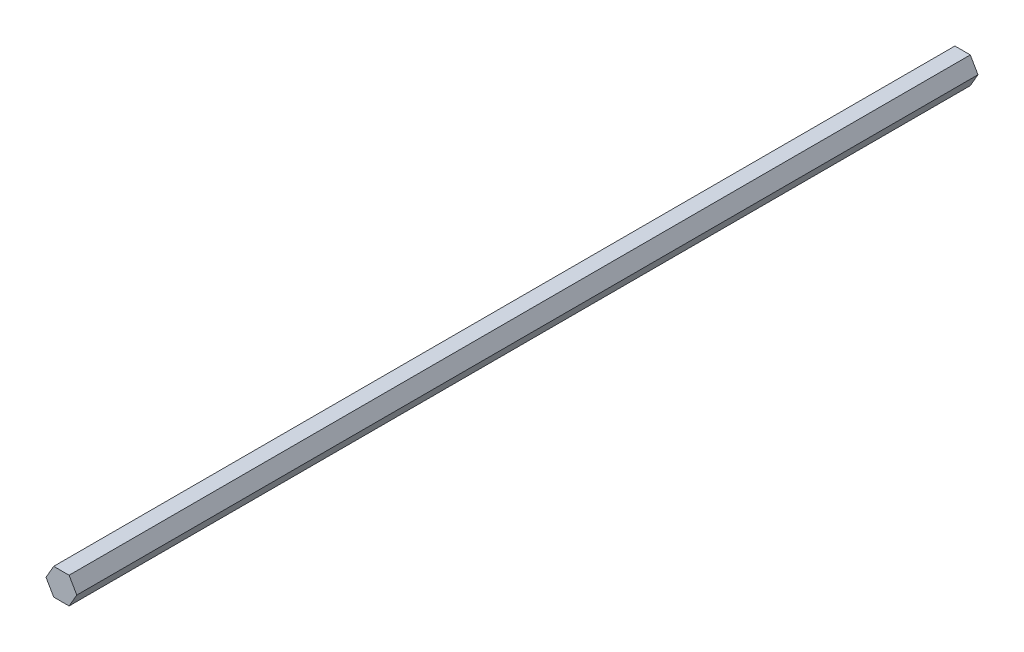
ISO-10303-21;
HEADER;
FILE_DESCRIPTION(('STEP AP214'),'2;1');
FILE_NAME('part.step','',(''),(''),'','','');
FILE_SCHEMA(('AUTOMOTIVE_DESIGN { 1 0 10303 214 1 1 1 1 }'));
ENDSEC;
DATA;
#1=APPLICATION_CONTEXT('core data for automotive mechanical design processes');
#2=APPLICATION_PROTOCOL_DEFINITION('international standard','automotive_design',2000,#1);
#3=PRODUCT_CONTEXT('',#1,'mechanical');
#4=PRODUCT('Part','Part','',(#3));
#5=PRODUCT_RELATED_PRODUCT_CATEGORY('part','',(#4));
#6=PRODUCT_DEFINITION_FORMATION('','',#4);
#7=PRODUCT_DEFINITION_CONTEXT('part definition',#1,'design');
#8=PRODUCT_DEFINITION('design','',#6,#7);
#9=PRODUCT_DEFINITION_SHAPE('','',#8);
#10=(LENGTH_UNIT() NAMED_UNIT(*) SI_UNIT(.MILLI.,.METRE.));
#11=(NAMED_UNIT(*) PLANE_ANGLE_UNIT() SI_UNIT($,.RADIAN.));
#12=(NAMED_UNIT(*) SI_UNIT($,.STERADIAN.) SOLID_ANGLE_UNIT());
#13=UNCERTAINTY_MEASURE_WITH_UNIT(LENGTH_MEASURE(1.E-05),#10,'distance_accuracy_value','');
#14=(GEOMETRIC_REPRESENTATION_CONTEXT(3) GLOBAL_UNCERTAINTY_ASSIGNED_CONTEXT((#13)) GLOBAL_UNIT_ASSIGNED_CONTEXT((#10,
#11,#12)) REPRESENTATION_CONTEXT('',''));
#15=CARTESIAN_POINT('',(0.,0.,0.));
#16=DIRECTION('',(0.,0.,1.));
#17=DIRECTION('',(1.,0.,0.));
#18=AXIS2_PLACEMENT_3D('',#15,#16,#17);
#19=CARTESIAN_POINT('',(3.615,6.26136366936149,423.18));
#20=DIRECTION('',(0.,-1.,0.));
#21=DIRECTION('',(1.,0.,0.));
#22=AXIS2_PLACEMENT_3D('',#19,#20,#21);
#23=PLANE('',#22);
#24=DIRECTION('',(-1.,0.,0.));
#25=VECTOR('',#24,1.);
#26=CARTESIAN_POINT('',(3.615,6.26136366936149,0.));
#27=LINE('',#26,#25);
#28=CARTESIAN_POINT('',(3.615,6.26136366936149,0.));
#29=VERTEX_POINT('',#28);
#30=CARTESIAN_POINT('',(-3.615,6.26136366936149,0.));
#31=VERTEX_POINT('',#30);
#32=EDGE_CURVE('E117',#29,#31,#27,.T.);
#33=ORIENTED_EDGE('',*,*,#32,.T.);
#34=DIRECTION('',(0.,0.,-1.));
#35=VECTOR('',#34,1.);
#36=CARTESIAN_POINT('',(-3.615,6.26136366936149,423.18));
#37=LINE('',#36,#35);
#38=CARTESIAN_POINT('',(-3.615,6.26136366936149,423.18));
#39=VERTEX_POINT('',#38);
#40=EDGE_CURVE('E11',#39,#31,#37,.T.);
#41=ORIENTED_EDGE('',*,*,#40,.F.);
#42=DIRECTION('',(-1.,0.,0.));
#43=VECTOR('',#42,1.);
#44=CARTESIAN_POINT('',(3.615,6.26136366936149,423.18));
#45=LINE('',#44,#43);
#46=CARTESIAN_POINT('',(3.615,6.26136366936149,423.18));
#47=VERTEX_POINT('',#46);
#48=EDGE_CURVE('E127',#47,#39,#45,.T.);
#49=ORIENTED_EDGE('',*,*,#48,.F.);
#50=DIRECTION('',(0.,0.,-1.));
#51=VECTOR('',#50,1.);
#52=CARTESIAN_POINT('',(3.615,6.26136366936149,423.18));
#53=LINE('',#52,#51);
#54=EDGE_CURVE('E113',#47,#29,#53,.T.);
#55=ORIENTED_EDGE('',*,*,#54,.T.);
#56=EDGE_LOOP('',(#33,#41,#49,#55));
#57=FACE_BOUND('',#56,.T.);
#58=ADVANCED_FACE('F33',(#57),#23,.F.);
#59=CARTESIAN_POINT('',(-3.615,6.26136366936149,423.18));
#60=DIRECTION('',(0.866025403784439,-0.5,0.));
#61=DIRECTION('',(0.5,0.866025403784439,0.));
#62=AXIS2_PLACEMENT_3D('',#59,#60,#61);
#63=PLANE('',#62);
#64=DIRECTION('',(-0.5,-0.866025403784439,0.));
#65=VECTOR('',#64,1.);
#66=CARTESIAN_POINT('',(-3.615,6.26136366936149,0.));
#67=LINE('',#66,#65);
#68=CARTESIAN_POINT('',(-7.23,0.,0.));
#69=VERTEX_POINT('',#68);
#70=EDGE_CURVE('E120',#31,#69,#67,.T.);
#71=ORIENTED_EDGE('',*,*,#70,.T.);
#72=DIRECTION('',(0.,0.,-1.));
#73=VECTOR('',#72,1.);
#74=CARTESIAN_POINT('',(-7.23,0.,423.18));
#75=LINE('',#74,#73);
#76=CARTESIAN_POINT('',(-7.23,0.,423.18));
#77=VERTEX_POINT('',#76);
#78=EDGE_CURVE('E41',#77,#69,#75,.T.);
#79=ORIENTED_EDGE('',*,*,#78,.F.);
#80=DIRECTION('',(-0.5,-0.866025403784439,0.));
#81=VECTOR('',#80,1.);
#82=CARTESIAN_POINT('',(-3.615,6.26136366936149,423.18));
#83=LINE('',#82,#81);
#84=EDGE_CURVE('E86',#39,#77,#83,.T.);
#85=ORIENTED_EDGE('',*,*,#84,.F.);
#86=ORIENTED_EDGE('',*,*,#40,.T.);
#87=EDGE_LOOP('',(#71,#79,#85,#86));
#88=FACE_BOUND('',#87,.T.);
#89=ADVANCED_FACE('F151',(#88),#63,.F.);
#90=CARTESIAN_POINT('',(-7.23,0.,423.18));
#91=DIRECTION('',(0.866025403784438,0.5,0.));
#92=DIRECTION('',(-0.5,0.866025403784439,0.));
#93=AXIS2_PLACEMENT_3D('',#90,#91,#92);
#94=PLANE('',#93);
#95=DIRECTION('',(0.5,-0.866025403784438,0.));
#96=VECTOR('',#95,1.);
#97=CARTESIAN_POINT('',(-7.23,0.,0.));
#98=LINE('',#97,#96);
#99=CARTESIAN_POINT('',(-3.615,-6.26136366936149,0.));
#100=VERTEX_POINT('',#99);
#101=EDGE_CURVE('E122',#69,#100,#98,.T.);
#102=ORIENTED_EDGE('',*,*,#101,.T.);
#103=DIRECTION('',(0.,0.,-1.));
#104=VECTOR('',#103,1.);
#105=CARTESIAN_POINT('',(-3.615,-6.26136366936149,423.18));
#106=LINE('',#105,#104);
#107=CARTESIAN_POINT('',(-3.615,-6.26136366936149,423.18));
#108=VERTEX_POINT('',#107);
#109=EDGE_CURVE('E108',#108,#100,#106,.T.);
#110=ORIENTED_EDGE('',*,*,#109,.F.);
#111=DIRECTION('',(0.5,-0.866025403784438,0.));
#112=VECTOR('',#111,1.);
#113=CARTESIAN_POINT('',(-7.23,0.,423.18));
#114=LINE('',#113,#112);
#115=EDGE_CURVE('E99',#77,#108,#114,.T.);
#116=ORIENTED_EDGE('',*,*,#115,.F.);
#117=ORIENTED_EDGE('',*,*,#78,.T.);
#118=EDGE_LOOP('',(#102,#110,#116,#117));
#119=FACE_BOUND('',#118,.T.);
#120=ADVANCED_FACE('F133',(#119),#94,.F.);
#121=CARTESIAN_POINT('',(-3.615,-6.26136366936149,423.18));
#122=DIRECTION('',(0.,1.,0.));
#123=DIRECTION('',(0.,0.,1.));
#124=AXIS2_PLACEMENT_3D('',#121,#122,#123);
#125=PLANE('',#124);
#126=DIRECTION('',(1.,0.,0.));
#127=VECTOR('',#126,1.);
#128=CARTESIAN_POINT('',(-3.615,-6.26136366936149,0.));
#129=LINE('',#128,#127);
#130=CARTESIAN_POINT('',(3.615,-6.26136366936149,0.));
#131=VERTEX_POINT('',#130);
#132=EDGE_CURVE('E107',#100,#131,#129,.T.);
#133=ORIENTED_EDGE('',*,*,#132,.T.);
#134=DIRECTION('',(0.,0.,-1.));
#135=VECTOR('',#134,1.);
#136=CARTESIAN_POINT('',(3.615,-6.26136366936149,423.18));
#137=LINE('',#136,#135);
#138=CARTESIAN_POINT('',(3.615,-6.26136366936149,423.18));
#139=VERTEX_POINT('',#138);
#140=EDGE_CURVE('E104',#139,#131,#137,.T.);
#141=ORIENTED_EDGE('',*,*,#140,.F.);
#142=DIRECTION('',(1.,0.,0.));
#143=VECTOR('',#142,1.);
#144=CARTESIAN_POINT('',(-3.615,-6.26136366936149,423.18));
#145=LINE('',#144,#143);
#146=EDGE_CURVE('E93',#108,#139,#145,.T.);
#147=ORIENTED_EDGE('',*,*,#146,.F.);
#148=ORIENTED_EDGE('',*,*,#109,.T.);
#149=EDGE_LOOP('',(#133,#141,#147,#148));
#150=FACE_BOUND('',#149,.T.);
#151=ADVANCED_FACE('F105',(#150),#125,.F.);
#152=CARTESIAN_POINT('',(3.615,-6.26136366936149,423.18));
#153=DIRECTION('',(-0.866025403784439,0.5,0.));
#154=DIRECTION('',(-0.5,-0.866025403784439,0.));
#155=AXIS2_PLACEMENT_3D('',#152,#153,#154);
#156=PLANE('',#155);
#157=DIRECTION('',(0.5,0.866025403784439,0.));
#158=VECTOR('',#157,1.);
#159=CARTESIAN_POINT('',(3.615,-6.26136366936149,0.));
#160=LINE('',#159,#158);
#161=CARTESIAN_POINT('',(7.23,0.,0.));
#162=VERTEX_POINT('',#161);
#163=EDGE_CURVE('E72',#131,#162,#160,.T.);
#164=ORIENTED_EDGE('',*,*,#163,.T.);
#165=DIRECTION('',(0.,0.,-1.));
#166=VECTOR('',#165,1.);
#167=CARTESIAN_POINT('',(7.23,0.,423.18));
#168=LINE('',#167,#166);
#169=CARTESIAN_POINT('',(7.23,0.,423.18));
#170=VERTEX_POINT('',#169);
#171=EDGE_CURVE('E109',#170,#162,#168,.T.);
#172=ORIENTED_EDGE('',*,*,#171,.F.);
#173=DIRECTION('',(0.5,0.866025403784439,0.));
#174=VECTOR('',#173,1.);
#175=CARTESIAN_POINT('',(3.615,-6.26136366936149,423.18));
#176=LINE('',#175,#174);
#177=EDGE_CURVE('E97',#139,#170,#176,.T.);
#178=ORIENTED_EDGE('',*,*,#177,.F.);
#179=ORIENTED_EDGE('',*,*,#140,.T.);
#180=EDGE_LOOP('',(#164,#172,#178,#179));
#181=FACE_BOUND('',#180,.T.);
#182=ADVANCED_FACE('F111',(#181),#156,.F.);
#183=CARTESIAN_POINT('',(7.23,0.,423.18));
#184=DIRECTION('',(-0.866025403784439,-0.5,0.));
#185=DIRECTION('',(0.5,-0.866025403784439,0.));
#186=AXIS2_PLACEMENT_3D('',#183,#184,#185);
#187=PLANE('',#186);
#188=DIRECTION('',(-0.5,0.866025403784439,0.));
#189=VECTOR('',#188,1.);
#190=CARTESIAN_POINT('',(7.23,0.,0.));
#191=LINE('',#190,#189);
#192=EDGE_CURVE('E78',#162,#29,#191,.T.);
#193=ORIENTED_EDGE('',*,*,#192,.T.);
#194=ORIENTED_EDGE('',*,*,#54,.F.);
#195=DIRECTION('',(-0.5,0.866025403784439,0.));
#196=VECTOR('',#195,1.);
#197=CARTESIAN_POINT('',(7.23,0.,423.18));
#198=LINE('',#197,#196);
#199=EDGE_CURVE('E49',#170,#47,#198,.T.);
#200=ORIENTED_EDGE('',*,*,#199,.F.);
#201=ORIENTED_EDGE('',*,*,#171,.T.);
#202=EDGE_LOOP('',(#193,#194,#200,#201));
#203=FACE_BOUND('',#202,.T.);
#204=ADVANCED_FACE('F140',(#203),#187,.F.);
#205=CARTESIAN_POINT('',(0.,0.,423.18));
#206=DIRECTION('',(0.,0.,1.));
#207=DIRECTION('',(1.,0.,0.));
#208=AXIS2_PLACEMENT_3D('',#205,#206,#207);
#209=PLANE('',#208);
#210=ORIENTED_EDGE('',*,*,#48,.T.);
#211=ORIENTED_EDGE('',*,*,#84,.T.);
#212=ORIENTED_EDGE('',*,*,#115,.T.);
#213=ORIENTED_EDGE('',*,*,#146,.T.);
#214=ORIENTED_EDGE('',*,*,#177,.T.);
#215=ORIENTED_EDGE('',*,*,#199,.T.);
#216=EDGE_LOOP('',(#210,#211,#212,#213,#214,#215));
#217=FACE_BOUND('',#216,.T.);
#218=ADVANCED_FACE('F95',(#217),#209,.T.);
#219=CARTESIAN_POINT('',(0.,0.,0.));
#220=DIRECTION('',(0.,0.,1.));
#221=DIRECTION('',(1.,0.,0.));
#222=AXIS2_PLACEMENT_3D('',#219,#220,#221);
#223=PLANE('',#222);
#224=ORIENTED_EDGE('',*,*,#32,.F.);
#225=ORIENTED_EDGE('',*,*,#192,.F.);
#226=ORIENTED_EDGE('',*,*,#163,.F.);
#227=ORIENTED_EDGE('',*,*,#132,.F.);
#228=ORIENTED_EDGE('',*,*,#101,.F.);
#229=ORIENTED_EDGE('',*,*,#70,.F.);
#230=EDGE_LOOP('',(#224,#225,#226,#227,#228,#229));
#231=FACE_BOUND('',#230,.T.);
#232=ADVANCED_FACE('F136',(#231),#223,.F.);
#233=CLOSED_SHELL('',(#58,#89,#120,#151,#182,#204,#218,#232));
#234=MANIFOLD_SOLID_BREP('B2',#233);
#235=ADVANCED_BREP_SHAPE_REPRESENTATION('',(#18,#234),#14);
#236=SHAPE_DEFINITION_REPRESENTATION(#9,#235);
ENDSEC;
END-ISO-10303-21;
